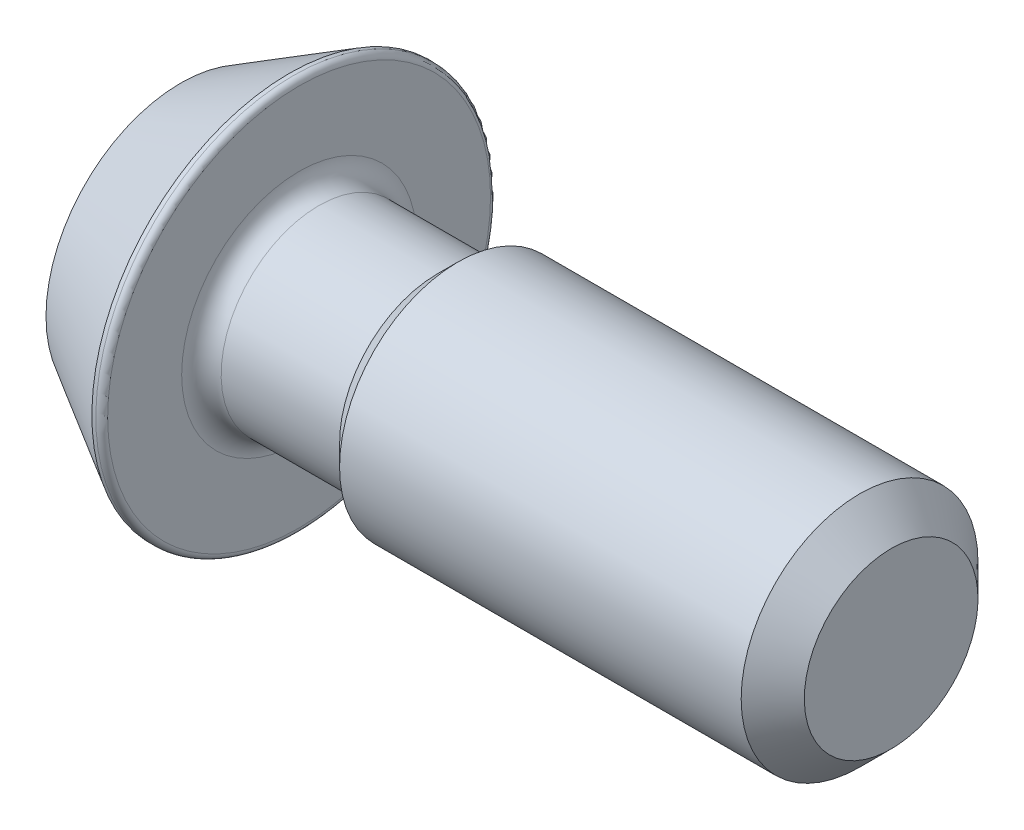
ISO-10303-21;
HEADER;
FILE_DESCRIPTION(('STEP AP214'),'2;1');
FILE_NAME('part.step','',(''),(''),'','','');
FILE_SCHEMA(('AUTOMOTIVE_DESIGN { 1 0 10303 214 1 1 1 1 }'));
ENDSEC;
DATA;
#1=APPLICATION_CONTEXT('core data for automotive mechanical design processes');
#2=APPLICATION_PROTOCOL_DEFINITION('international standard','automotive_design',2000,#1);
#3=PRODUCT_CONTEXT('',#1,'mechanical');
#4=PRODUCT('Part','Part','',(#3));
#5=PRODUCT_RELATED_PRODUCT_CATEGORY('part','',(#4));
#6=PRODUCT_DEFINITION_FORMATION('','',#4);
#7=PRODUCT_DEFINITION_CONTEXT('part definition',#1,'design');
#8=PRODUCT_DEFINITION('design','',#6,#7);
#9=PRODUCT_DEFINITION_SHAPE('','',#8);
#10=(LENGTH_UNIT() NAMED_UNIT(*) SI_UNIT(.MILLI.,.METRE.));
#11=(NAMED_UNIT(*) PLANE_ANGLE_UNIT() SI_UNIT($,.RADIAN.));
#12=(NAMED_UNIT(*) SI_UNIT($,.STERADIAN.) SOLID_ANGLE_UNIT());
#13=UNCERTAINTY_MEASURE_WITH_UNIT(LENGTH_MEASURE(1.E-05),#10,'distance_accuracy_value','');
#14=(GEOMETRIC_REPRESENTATION_CONTEXT(3) GLOBAL_UNCERTAINTY_ASSIGNED_CONTEXT((#13)) GLOBAL_UNIT_ASSIGNED_CONTEXT((#10,
#11,#12)) REPRESENTATION_CONTEXT('',''));
#15=CARTESIAN_POINT('',(0.,0.,0.));
#16=DIRECTION('',(0.,0.,1.));
#17=DIRECTION('',(1.,0.,0.));
#18=AXIS2_PLACEMENT_3D('',#15,#16,#17);
#19=CARTESIAN_POINT('',(0.,0.,0.));
#20=DIRECTION('',(-1.,0.,0.));
#21=DIRECTION('',(0.,-1.,0.));
#22=AXIS2_PLACEMENT_3D('',#19,#20,#21);
#23=PLANE('',#22);
#24=DIRECTION('',(0.,0.866025403784438,-0.5));
#25=VECTOR('',#24,1.);
#26=CARTESIAN_POINT('',(0.,0.,3.46410161513775));
#27=LINE('',#26,#25);
#28=CARTESIAN_POINT('',(0.,0.,3.46410161513775));
#29=VERTEX_POINT('',#28);
#30=CARTESIAN_POINT('',(0.,3.,1.73205080756888));
#31=VERTEX_POINT('',#30);
#32=EDGE_CURVE('E53',#29,#31,#27,.T.);
#33=ORIENTED_EDGE('',*,*,#32,.F.);
#34=DIRECTION('',(0.,0.866025403784438,0.5));
#35=VECTOR('',#34,1.);
#36=CARTESIAN_POINT('',(0.,-3.,1.73205080756888));
#37=LINE('',#36,#35);
#38=CARTESIAN_POINT('',(0.,-3.,1.73205080756888));
#39=VERTEX_POINT('',#38);
#40=EDGE_CURVE('E136',#39,#29,#37,.T.);
#41=ORIENTED_EDGE('',*,*,#40,.F.);
#42=DIRECTION('',(0.,0.,1.));
#43=VECTOR('',#42,1.);
#44=CARTESIAN_POINT('',(0.,-3.,-1.73205080756888));
#45=LINE('',#44,#43);
#46=CARTESIAN_POINT('',(0.,-3.,-1.73205080756888));
#47=VERTEX_POINT('',#46);
#48=EDGE_CURVE('E134',#47,#39,#45,.T.);
#49=ORIENTED_EDGE('',*,*,#48,.F.);
#50=DIRECTION('',(0.,-0.866025403784438,0.5));
#51=VECTOR('',#50,1.);
#52=CARTESIAN_POINT('',(0.,0.,-3.46410161513775));
#53=LINE('',#52,#51);
#54=CARTESIAN_POINT('',(0.,0.,-3.46410161513775));
#55=VERTEX_POINT('',#54);
#56=EDGE_CURVE('E101',#55,#47,#53,.T.);
#57=ORIENTED_EDGE('',*,*,#56,.F.);
#58=DIRECTION('',(0.,-0.866025403784439,-0.5));
#59=VECTOR('',#58,1.);
#60=CARTESIAN_POINT('',(0.,3.,-1.73205080756888));
#61=LINE('',#60,#59);
#62=CARTESIAN_POINT('',(0.,3.,-1.73205080756888));
#63=VERTEX_POINT('',#62);
#64=EDGE_CURVE('E130',#63,#55,#61,.T.);
#65=ORIENTED_EDGE('',*,*,#64,.F.);
#66=DIRECTION('',(0.,0.,-1.));
#67=VECTOR('',#66,1.);
#68=CARTESIAN_POINT('',(0.,3.,1.73205080756888));
#69=LINE('',#68,#67);
#70=EDGE_CURVE('E127',#31,#63,#69,.T.);
#71=ORIENTED_EDGE('',*,*,#70,.F.);
#72=EDGE_LOOP('',(#33,#41,#49,#57,#65,#71));
#73=FACE_BOUND('',#72,.T.);
#74=CARTESIAN_POINT('',(0.,0.,0.));
#75=DIRECTION('',(1.,0.,0.));
#76=DIRECTION('',(0.,1.,0.));
#77=AXIS2_PLACEMENT_3D('',#74,#75,#76);
#78=CIRCLE('',#77,6.82457351945704);
#79=CARTESIAN_POINT('',(0.,6.82457351945704,0.));
#80=VERTEX_POINT('',#79);
#81=EDGE_CURVE('E154',#80,#80,#78,.T.);
#82=ORIENTED_EDGE('',*,*,#81,.F.);
#83=EDGE_LOOP('',(#82));
#84=FACE_BOUND('',#83,.T.);
#85=ADVANCED_FACE('F38',(#73,#84),#23,.T.);
#86=CARTESIAN_POINT('',(5.5,0.,0.));
#87=DIRECTION('',(1.,0.,0.));
#88=DIRECTION('',(0.,1.,0.));
#89=AXIS2_PLACEMENT_3D('',#86,#87,#88);
#90=CONICAL_SURFACE('',#89,9.99999999999999,0.5235987755983);
#91=ORIENTED_EDGE('',*,*,#81,.T.);
#92=EDGE_LOOP('',(#91));
#93=FACE_BOUND('',#92,.T.);
#94=CARTESIAN_POINT('',(5.5,0.,0.));
#95=DIRECTION('',(1.,0.,0.));
#96=DIRECTION('',(0.,1.,0.));
#97=AXIS2_PLACEMENT_3D('',#94,#95,#96);
#98=CIRCLE('',#97,9.99999999999999);
#99=CARTESIAN_POINT('',(5.5,10.,0.));
#100=VERTEX_POINT('',#99);
#101=EDGE_CURVE('E151',#100,#100,#98,.T.);
#102=ORIENTED_EDGE('',*,*,#101,.F.);
#103=EDGE_LOOP('',(#102));
#104=FACE_BOUND('',#103,.T.);
#105=ADVANCED_FACE('F184',(#93,#104),#90,.T.);
#106=CARTESIAN_POINT('',(36.,0.,0.));
#107=DIRECTION('',(1.,0.,0.));
#108=DIRECTION('',(0.,1.,0.));
#109=AXIS2_PLACEMENT_3D('',#106,#107,#108);
#110=CYLINDRICAL_SURFACE('',#109,9.99999999999999);
#111=CARTESIAN_POINT('',(5.7,0.,0.));
#112=DIRECTION('',(1.,0.,0.));
#113=DIRECTION('',(0.,1.,0.));
#114=AXIS2_PLACEMENT_3D('',#111,#112,#113);
#115=CIRCLE('',#114,9.99999999999999);
#116=CARTESIAN_POINT('',(5.69999999999999,10.,0.));
#117=VERTEX_POINT('',#116);
#118=EDGE_CURVE('E160',#117,#117,#115,.F.);
#119=ORIENTED_EDGE('',*,*,#118,.T.);
#120=EDGE_LOOP('',(#119));
#121=FACE_BOUND('',#120,.T.);
#122=ORIENTED_EDGE('',*,*,#101,.T.);
#123=EDGE_LOOP('',(#122));
#124=FACE_BOUND('',#123,.T.);
#125=ADVANCED_FACE('F190',(#121,#124),#110,.T.);
#126=CARTESIAN_POINT('',(6.,10.,0.));
#127=DIRECTION('',(1.,0.,0.));
#128=DIRECTION('',(0.,1.,0.));
#129=AXIS2_PLACEMENT_3D('',#126,#127,#128);
#130=PLANE('',#129);
#131=CARTESIAN_POINT('',(6.,0.,0.));
#132=DIRECTION('',(1.,0.,0.));
#133=DIRECTION('',(0.,1.,0.));
#134=AXIS2_PLACEMENT_3D('',#131,#132,#133);
#135=CIRCLE('',#134,5.95);
#136=CARTESIAN_POINT('',(6.,5.95,0.));
#137=VERTEX_POINT('',#136);
#138=EDGE_CURVE('E11',#137,#137,#135,.F.);
#139=ORIENTED_EDGE('',*,*,#138,.T.);
#140=EDGE_LOOP('',(#139));
#141=FACE_BOUND('',#140,.T.);
#142=CARTESIAN_POINT('',(6.,0.,0.));
#143=DIRECTION('',(1.,0.,0.));
#144=DIRECTION('',(0.,1.,0.));
#145=AXIS2_PLACEMENT_3D('',#142,#143,#144);
#146=CIRCLE('',#145,9.7);
#147=CARTESIAN_POINT('',(6.,9.7,0.));
#148=VERTEX_POINT('',#147);
#149=EDGE_CURVE('E157',#148,#148,#146,.T.);
#150=ORIENTED_EDGE('',*,*,#149,.T.);
#151=EDGE_LOOP('',(#150));
#152=FACE_BOUND('',#151,.T.);
#153=ADVANCED_FACE('F210',(#141,#152),#130,.T.);
#154=CARTESIAN_POINT('',(36.,0.,0.));
#155=DIRECTION('',(1.,0.,0.));
#156=DIRECTION('',(0.,1.,0.));
#157=AXIS2_PLACEMENT_3D('',#154,#155,#156);
#158=CYLINDRICAL_SURFACE('',#157,4.95);
#159=CARTESIAN_POINT('',(7.,0.,0.));
#160=DIRECTION('',(1.,0.,0.));
#161=DIRECTION('',(0.,1.,0.));
#162=AXIS2_PLACEMENT_3D('',#159,#160,#161);
#163=CIRCLE('',#162,4.95);
#164=CARTESIAN_POINT('',(7.,4.95,0.));
#165=VERTEX_POINT('',#164);
#166=EDGE_CURVE('E46',#165,#165,#163,.T.);
#167=ORIENTED_EDGE('',*,*,#166,.T.);
#168=EDGE_LOOP('',(#167));
#169=FACE_BOUND('',#168,.T.);
#170=CARTESIAN_POINT('',(13.,0.,0.));
#171=DIRECTION('',(1.,0.,0.));
#172=DIRECTION('',(0.,1.,0.));
#173=AXIS2_PLACEMENT_3D('',#170,#171,#172);
#174=CIRCLE('',#173,4.95);
#175=CARTESIAN_POINT('',(13.,4.95,0.));
#176=VERTEX_POINT('',#175);
#177=EDGE_CURVE('E148',#176,#176,#174,.T.);
#178=ORIENTED_EDGE('',*,*,#177,.F.);
#179=EDGE_LOOP('',(#178));
#180=FACE_BOUND('',#179,.T.);
#181=ADVANCED_FACE('F171',(#169,#180),#158,.T.);
#182=CARTESIAN_POINT('',(14.05,0.,0.));
#183=DIRECTION('',(1.,0.,0.));
#184=DIRECTION('',(0.,1.,0.));
#185=AXIS2_PLACEMENT_3D('',#182,#183,#184);
#186=CONICAL_SURFACE('',#185,5.99999999999999,0.78539816339745);
#187=ORIENTED_EDGE('',*,*,#177,.T.);
#188=EDGE_LOOP('',(#187));
#189=FACE_BOUND('',#188,.T.);
#190=CARTESIAN_POINT('',(14.05,0.,0.));
#191=DIRECTION('',(1.,0.,0.));
#192=DIRECTION('',(0.,1.,0.));
#193=AXIS2_PLACEMENT_3D('',#190,#191,#192);
#194=CIRCLE('',#193,5.99999999999999);
#195=CARTESIAN_POINT('',(14.05,6.,0.));
#196=VERTEX_POINT('',#195);
#197=EDGE_CURVE('E140',#196,#196,#194,.T.);
#198=ORIENTED_EDGE('',*,*,#197,.F.);
#199=EDGE_LOOP('',(#198));
#200=FACE_BOUND('',#199,.T.);
#201=ADVANCED_FACE('F218',(#189,#200),#186,.T.);
#202=CARTESIAN_POINT('',(36.,0.,0.));
#203=DIRECTION('',(1.,0.,0.));
#204=DIRECTION('',(0.,1.,0.));
#205=AXIS2_PLACEMENT_3D('',#202,#203,#204);
#206=CYLINDRICAL_SURFACE('',#205,5.99999999999999);
#207=CARTESIAN_POINT('',(34.4,0.,0.));
#208=DIRECTION('',(1.,0.,0.));
#209=DIRECTION('',(0.,1.,0.));
#210=AXIS2_PLACEMENT_3D('',#207,#208,#209);
#211=CIRCLE('',#210,5.99999999999999);
#212=CARTESIAN_POINT('',(34.4,6.,0.));
#213=VERTEX_POINT('',#212);
#214=EDGE_CURVE('E166',#213,#213,#211,.F.);
#215=ORIENTED_EDGE('',*,*,#214,.T.);
#216=EDGE_LOOP('',(#215));
#217=FACE_BOUND('',#216,.T.);
#218=ORIENTED_EDGE('',*,*,#197,.T.);
#219=EDGE_LOOP('',(#218));
#220=FACE_BOUND('',#219,.T.);
#221=ADVANCED_FACE('F224',(#217,#220),#206,.T.);
#222=CARTESIAN_POINT('',(36.,6.,0.));
#223=DIRECTION('',(1.,0.,0.));
#224=DIRECTION('',(0.,1.,0.));
#225=AXIS2_PLACEMENT_3D('',#222,#223,#224);
#226=PLANE('',#225);
#227=CARTESIAN_POINT('',(36.,0.,0.));
#228=DIRECTION('',(1.,0.,0.));
#229=DIRECTION('',(0.,1.,0.));
#230=AXIS2_PLACEMENT_3D('',#227,#228,#229);
#231=CIRCLE('',#230,4.4);
#232=CARTESIAN_POINT('',(36.,4.40000000000001,0.));
#233=VERTEX_POINT('',#232);
#234=EDGE_CURVE('E163',#233,#233,#231,.T.);
#235=ORIENTED_EDGE('',*,*,#234,.T.);
#236=EDGE_LOOP('',(#235));
#237=FACE_BOUND('',#236,.T.);
#238=ADVANCED_FACE('F228',(#237),#226,.T.);
#239=CARTESIAN_POINT('',(4.,0.,3.46410161513775));
#240=DIRECTION('',(0.,0.5,0.866025403784438));
#241=DIRECTION('',(0.,-0.866025403784439,0.5));
#242=AXIS2_PLACEMENT_3D('',#239,#240,#241);
#243=PLANE('',#242);
#244=ORIENTED_EDGE('',*,*,#32,.T.);
#245=DIRECTION('',(-1.,0.,0.));
#246=VECTOR('',#245,1.);
#247=CARTESIAN_POINT('',(4.,3.,1.73205080756888));
#248=LINE('',#247,#246);
#249=CARTESIAN_POINT('',(4.,3.,1.73205080756888));
#250=VERTEX_POINT('',#249);
#251=EDGE_CURVE('E83',#250,#31,#248,.T.);
#252=ORIENTED_EDGE('',*,*,#251,.F.);
#253=DIRECTION('',(0.,0.866025403784438,-0.5));
#254=VECTOR('',#253,1.);
#255=CARTESIAN_POINT('',(4.,0.,3.46410161513775));
#256=LINE('',#255,#254);
#257=CARTESIAN_POINT('',(4.,0.,3.46410161513775));
#258=VERTEX_POINT('',#257);
#259=EDGE_CURVE('E138',#258,#250,#256,.T.);
#260=ORIENTED_EDGE('',*,*,#259,.F.);
#261=DIRECTION('',(-1.,0.,0.));
#262=VECTOR('',#261,1.);
#263=CARTESIAN_POINT('',(4.,0.,3.46410161513775));
#264=LINE('',#263,#262);
#265=EDGE_CURVE('E61',#258,#29,#264,.T.);
#266=ORIENTED_EDGE('',*,*,#265,.T.);
#267=EDGE_LOOP('',(#244,#252,#260,#266));
#268=FACE_BOUND('',#267,.T.);
#269=ADVANCED_FACE('F232',(#268),#243,.F.);
#270=CARTESIAN_POINT('',(4.,-3.,1.73205080756888));
#271=DIRECTION('',(0.,-0.5,0.866025403784439));
#272=DIRECTION('',(0.,-0.866025403784438,-0.5));
#273=AXIS2_PLACEMENT_3D('',#270,#271,#272);
#274=PLANE('',#273);
#275=ORIENTED_EDGE('',*,*,#40,.T.);
#276=ORIENTED_EDGE('',*,*,#265,.F.);
#277=DIRECTION('',(0.,0.866025403784438,0.5));
#278=VECTOR('',#277,1.);
#279=CARTESIAN_POINT('',(4.,-3.,1.73205080756888));
#280=LINE('',#279,#278);
#281=CARTESIAN_POINT('',(4.,-3.,1.73205080756888));
#282=VERTEX_POINT('',#281);
#283=EDGE_CURVE('E113',#282,#258,#280,.T.);
#284=ORIENTED_EDGE('',*,*,#283,.F.);
#285=DIRECTION('',(-1.,0.,0.));
#286=VECTOR('',#285,1.);
#287=CARTESIAN_POINT('',(4.,-3.,1.73205080756888));
#288=LINE('',#287,#286);
#289=EDGE_CURVE('E105',#282,#39,#288,.T.);
#290=ORIENTED_EDGE('',*,*,#289,.T.);
#291=EDGE_LOOP('',(#275,#276,#284,#290));
#292=FACE_BOUND('',#291,.T.);
#293=ADVANCED_FACE('F236',(#292),#274,.F.);
#294=CARTESIAN_POINT('',(4.,-3.,-1.73205080756888));
#295=DIRECTION('',(0.,-1.,0.));
#296=DIRECTION('',(0.,0.,-1.));
#297=AXIS2_PLACEMENT_3D('',#294,#295,#296);
#298=PLANE('',#297);
#299=ORIENTED_EDGE('',*,*,#48,.T.);
#300=ORIENTED_EDGE('',*,*,#289,.F.);
#301=DIRECTION('',(0.,0.,1.));
#302=VECTOR('',#301,1.);
#303=CARTESIAN_POINT('',(4.,-3.,-1.73205080756888));
#304=LINE('',#303,#302);
#305=CARTESIAN_POINT('',(4.,-3.,-1.73205080756888));
#306=VERTEX_POINT('',#305);
#307=EDGE_CURVE('E109',#306,#282,#304,.T.);
#308=ORIENTED_EDGE('',*,*,#307,.F.);
#309=DIRECTION('',(-1.,0.,0.));
#310=VECTOR('',#309,1.);
#311=CARTESIAN_POINT('',(4.,-3.,-1.73205080756888));
#312=LINE('',#311,#310);
#313=EDGE_CURVE('E94',#306,#47,#312,.T.);
#314=ORIENTED_EDGE('',*,*,#313,.T.);
#315=EDGE_LOOP('',(#299,#300,#308,#314));
#316=FACE_BOUND('',#315,.T.);
#317=ADVANCED_FACE('F110',(#316),#298,.F.);
#318=CARTESIAN_POINT('',(4.,0.,-3.46410161513775));
#319=DIRECTION('',(0.,-0.5,-0.866025403784438));
#320=DIRECTION('',(0.,0.866025403784439,-0.5));
#321=AXIS2_PLACEMENT_3D('',#318,#319,#320);
#322=PLANE('',#321);
#323=ORIENTED_EDGE('',*,*,#56,.T.);
#324=ORIENTED_EDGE('',*,*,#313,.F.);
#325=DIRECTION('',(0.,-0.866025403784438,0.5));
#326=VECTOR('',#325,1.);
#327=CARTESIAN_POINT('',(4.,0.,-3.46410161513775));
#328=LINE('',#327,#326);
#329=CARTESIAN_POINT('',(4.,0.,-3.46410161513775));
#330=VERTEX_POINT('',#329);
#331=EDGE_CURVE('E98',#330,#306,#328,.T.);
#332=ORIENTED_EDGE('',*,*,#331,.F.);
#333=DIRECTION('',(-1.,0.,0.));
#334=VECTOR('',#333,1.);
#335=CARTESIAN_POINT('',(4.,0.,-3.46410161513775));
#336=LINE('',#335,#334);
#337=EDGE_CURVE('E106',#330,#55,#336,.T.);
#338=ORIENTED_EDGE('',*,*,#337,.T.);
#339=EDGE_LOOP('',(#323,#324,#332,#338));
#340=FACE_BOUND('',#339,.T.);
#341=ADVANCED_FACE('F96',(#340),#322,.F.);
#342=CARTESIAN_POINT('',(4.,3.,-1.73205080756888));
#343=DIRECTION('',(0.,0.5,-0.866025403784439));
#344=DIRECTION('',(0.,0.866025403784439,0.5));
#345=AXIS2_PLACEMENT_3D('',#342,#343,#344);
#346=PLANE('',#345);
#347=ORIENTED_EDGE('',*,*,#64,.T.);
#348=ORIENTED_EDGE('',*,*,#337,.F.);
#349=DIRECTION('',(0.,-0.866025403784439,-0.5));
#350=VECTOR('',#349,1.);
#351=CARTESIAN_POINT('',(4.,3.,-1.73205080756888));
#352=LINE('',#351,#350);
#353=CARTESIAN_POINT('',(4.,3.,-1.73205080756888));
#354=VERTEX_POINT('',#353);
#355=EDGE_CURVE('E119',#354,#330,#352,.T.);
#356=ORIENTED_EDGE('',*,*,#355,.F.);
#357=DIRECTION('',(-1.,0.,0.));
#358=VECTOR('',#357,1.);
#359=CARTESIAN_POINT('',(4.,3.,-1.73205080756888));
#360=LINE('',#359,#358);
#361=EDGE_CURVE('E143',#354,#63,#360,.T.);
#362=ORIENTED_EDGE('',*,*,#361,.T.);
#363=EDGE_LOOP('',(#347,#348,#356,#362));
#364=FACE_BOUND('',#363,.T.);
#365=ADVANCED_FACE('F239',(#364),#346,.F.);
#366=CARTESIAN_POINT('',(4.,3.,1.73205080756888));
#367=DIRECTION('',(0.,1.,0.));
#368=DIRECTION('',(0.,0.,1.));
#369=AXIS2_PLACEMENT_3D('',#366,#367,#368);
#370=PLANE('',#369);
#371=ORIENTED_EDGE('',*,*,#70,.T.);
#372=ORIENTED_EDGE('',*,*,#361,.F.);
#373=DIRECTION('',(0.,0.,-1.));
#374=VECTOR('',#373,1.);
#375=CARTESIAN_POINT('',(4.,3.,1.73205080756888));
#376=LINE('',#375,#374);
#377=EDGE_CURVE('E121',#250,#354,#376,.T.);
#378=ORIENTED_EDGE('',*,*,#377,.F.);
#379=ORIENTED_EDGE('',*,*,#251,.T.);
#380=EDGE_LOOP('',(#371,#372,#378,#379));
#381=FACE_BOUND('',#380,.T.);
#382=ADVANCED_FACE('F204',(#381),#370,.F.);
#383=CARTESIAN_POINT('',(4.,0.,0.));
#384=DIRECTION('',(-1.,0.,0.));
#385=DIRECTION('',(0.,0.,1.));
#386=AXIS2_PLACEMENT_3D('',#383,#384,#385);
#387=PLANE('',#386);
#388=ORIENTED_EDGE('',*,*,#259,.T.);
#389=ORIENTED_EDGE('',*,*,#377,.T.);
#390=ORIENTED_EDGE('',*,*,#355,.T.);
#391=ORIENTED_EDGE('',*,*,#331,.T.);
#392=ORIENTED_EDGE('',*,*,#307,.T.);
#393=ORIENTED_EDGE('',*,*,#283,.T.);
#394=EDGE_LOOP('',(#388,#389,#390,#391,#392,#393));
#395=FACE_BOUND('',#394,.T.);
#396=ADVANCED_FACE('F116',(#395),#387,.T.);
#397=CARTESIAN_POINT('',(5.7,0.,0.));
#398=DIRECTION('',(1.,0.,0.));
#399=DIRECTION('',(0.,1.,0.));
#400=AXIS2_PLACEMENT_3D('',#397,#398,#399);
#401=TOROIDAL_SURFACE('',#400,9.7,0.3);
#402=ORIENTED_EDGE('',*,*,#118,.F.);
#403=EDGE_LOOP('',(#402));
#404=FACE_BOUND('',#403,.T.);
#405=ORIENTED_EDGE('',*,*,#149,.F.);
#406=EDGE_LOOP('',(#405));
#407=FACE_BOUND('',#406,.T.);
#408=ADVANCED_FACE('F180',(#404,#407),#401,.T.);
#409=CARTESIAN_POINT('',(36.,0.,0.));
#410=DIRECTION('',(-1.,0.,0.));
#411=DIRECTION('',(0.,-1.,0.));
#412=AXIS2_PLACEMENT_3D('',#409,#410,#411);
#413=CONICAL_SURFACE('',#412,4.4,0.785398163397447);
#414=ORIENTED_EDGE('',*,*,#214,.F.);
#415=EDGE_LOOP('',(#414));
#416=FACE_BOUND('',#415,.T.);
#417=ORIENTED_EDGE('',*,*,#234,.F.);
#418=EDGE_LOOP('',(#417));
#419=FACE_BOUND('',#418,.T.);
#420=ADVANCED_FACE('F175',(#416,#419),#413,.T.);
#421=CARTESIAN_POINT('',(7.,0.,0.));
#422=DIRECTION('',(1.,0.,0.));
#423=DIRECTION('',(0.,1.,0.));
#424=AXIS2_PLACEMENT_3D('',#421,#422,#423);
#425=TOROIDAL_SURFACE('',#424,5.95,1.);
#426=ORIENTED_EDGE('',*,*,#138,.F.);
#427=EDGE_LOOP('',(#426));
#428=FACE_BOUND('',#427,.T.);
#429=ORIENTED_EDGE('',*,*,#166,.F.);
#430=EDGE_LOOP('',(#429));
#431=FACE_BOUND('',#430,.T.);
#432=ADVANCED_FACE('F40',(#428,#431),#425,.F.);
#433=CLOSED_SHELL('',(#85,#105,#125,#153,#181,#201,#221,#238,#269,#293,#317,#341,#365,#382,#396,
#408,#420,#432));
#434=MANIFOLD_SOLID_BREP('B2',#433);
#435=ADVANCED_BREP_SHAPE_REPRESENTATION('',(#18,#434),#14);
#436=SHAPE_DEFINITION_REPRESENTATION(#9,#435);
ENDSEC;
END-ISO-10303-21;
